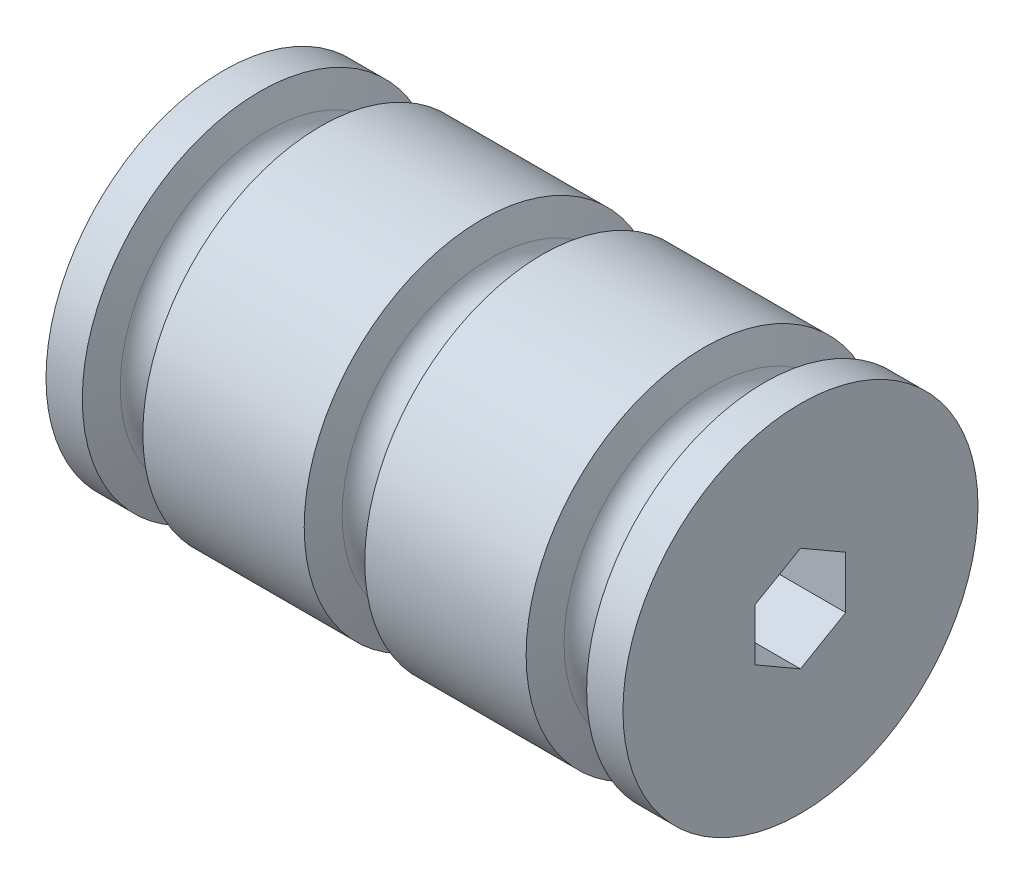
ISO-10303-21;
HEADER;
FILE_DESCRIPTION(('STEP AP214'),'2;1');
FILE_NAME('part.step','',(''),(''),'','','');
FILE_SCHEMA(('AUTOMOTIVE_DESIGN { 1 0 10303 214 1 1 1 1 }'));
ENDSEC;
DATA;
#1=APPLICATION_CONTEXT('core data for automotive mechanical design processes');
#2=APPLICATION_PROTOCOL_DEFINITION('international standard','automotive_design',2000,#1);
#3=PRODUCT_CONTEXT('',#1,'mechanical');
#4=PRODUCT('Part','Part','',(#3));
#5=PRODUCT_RELATED_PRODUCT_CATEGORY('part','',(#4));
#6=PRODUCT_DEFINITION_FORMATION('','',#4);
#7=PRODUCT_DEFINITION_CONTEXT('part definition',#1,'design');
#8=PRODUCT_DEFINITION('design','',#6,#7);
#9=PRODUCT_DEFINITION_SHAPE('','',#8);
#10=(LENGTH_UNIT() NAMED_UNIT(*) SI_UNIT(.MILLI.,.METRE.));
#11=(NAMED_UNIT(*) PLANE_ANGLE_UNIT() SI_UNIT($,.RADIAN.));
#12=(NAMED_UNIT(*) SI_UNIT($,.STERADIAN.) SOLID_ANGLE_UNIT());
#13=UNCERTAINTY_MEASURE_WITH_UNIT(LENGTH_MEASURE(1.E-05),#10,'distance_accuracy_value','');
#14=(GEOMETRIC_REPRESENTATION_CONTEXT(3) GLOBAL_UNCERTAINTY_ASSIGNED_CONTEXT((#13)) GLOBAL_UNIT_ASSIGNED_CONTEXT((#10,
#11,#12)) REPRESENTATION_CONTEXT('',''));
#15=CARTESIAN_POINT('',(0.,0.,0.));
#16=DIRECTION('',(0.,0.,1.));
#17=DIRECTION('',(1.,0.,0.));
#18=AXIS2_PLACEMENT_3D('',#15,#16,#17);
#19=CARTESIAN_POINT('',(0.,0.,0.));
#20=DIRECTION('',(1.,0.,0.));
#21=DIRECTION('',(0.,0.,-1.));
#22=AXIS2_PLACEMENT_3D('',#19,#20,#21);
#23=CYLINDRICAL_SURFACE('',#22,25.4);
#24=CARTESIAN_POINT('',(5.19484637298716,0.,0.));
#25=DIRECTION('',(1.,0.,0.));
#26=DIRECTION('',(0.,0.,-1.));
#27=AXIS2_PLACEMENT_3D('',#24,#25,#26);
#28=CIRCLE('',#27,25.4);
#29=CARTESIAN_POINT('',(5.19484637298716,0.,-25.4));
#30=VERTEX_POINT('',#29);
#31=EDGE_CURVE('E193',#30,#30,#28,.T.);
#32=ORIENTED_EDGE('',*,*,#31,.F.);
#33=EDGE_LOOP('',(#32));
#34=FACE_BOUND('',#33,.T.);
#35=CARTESIAN_POINT('',(0.,0.,0.));
#36=DIRECTION('',(1.,0.,0.));
#37=DIRECTION('',(0.,0.,-1.));
#38=AXIS2_PLACEMENT_3D('',#35,#36,#37);
#39=CIRCLE('',#38,25.4);
#40=CARTESIAN_POINT('',(0.,0.,-25.4));
#41=VERTEX_POINT('',#40);
#42=EDGE_CURVE('E11',#41,#41,#39,.T.);
#43=ORIENTED_EDGE('',*,*,#42,.T.);
#44=EDGE_LOOP('',(#43));
#45=FACE_BOUND('',#44,.T.);
#46=ADVANCED_FACE('F41',(#34,#45),#23,.T.);
#47=CARTESIAN_POINT('',(0.,0.,0.));
#48=DIRECTION('',(-1.,0.,0.));
#49=DIRECTION('',(0.,0.,1.));
#50=AXIS2_PLACEMENT_3D('',#47,#48,#49);
#51=PLANE('',#50);
#52=DIRECTION('',(0.,0.5,-0.866025403784439));
#53=VECTOR('',#52,1.);
#54=CARTESIAN_POINT('',(0.,3.73949769354121,6.477));
#55=LINE('',#54,#53);
#56=CARTESIAN_POINT('',(0.,3.73949769354121,6.477));
#57=VERTEX_POINT('',#56);
#58=CARTESIAN_POINT('',(0.,7.47899538708242,0.));
#59=VERTEX_POINT('',#58);
#60=EDGE_CURVE('E59',#57,#59,#55,.T.);
#61=ORIENTED_EDGE('',*,*,#60,.F.);
#62=DIRECTION('',(0.,1.,0.));
#63=VECTOR('',#62,1.);
#64=CARTESIAN_POINT('',(0.,-3.73949769354121,6.477));
#65=LINE('',#64,#63);
#66=CARTESIAN_POINT('',(0.,-3.73949769354121,6.477));
#67=VERTEX_POINT('',#66);
#68=EDGE_CURVE('E129',#67,#57,#65,.T.);
#69=ORIENTED_EDGE('',*,*,#68,.F.);
#70=DIRECTION('',(0.,0.5,0.866025403784439));
#71=VECTOR('',#70,1.);
#72=CARTESIAN_POINT('',(0.,-7.47899538708241,0.));
#73=LINE('',#72,#71);
#74=CARTESIAN_POINT('',(0.,-7.47899538708241,0.));
#75=VERTEX_POINT('',#74);
#76=EDGE_CURVE('E135',#75,#67,#73,.T.);
#77=ORIENTED_EDGE('',*,*,#76,.F.);
#78=DIRECTION('',(0.,-0.5,0.866025403784439));
#79=VECTOR('',#78,1.);
#80=CARTESIAN_POINT('',(0.,-3.73949769354121,-6.477));
#81=LINE('',#80,#79);
#82=CARTESIAN_POINT('',(0.,-3.73949769354121,-6.477));
#83=VERTEX_POINT('',#82);
#84=EDGE_CURVE('E158',#83,#75,#81,.T.);
#85=ORIENTED_EDGE('',*,*,#84,.F.);
#86=DIRECTION('',(0.,-1.,0.));
#87=VECTOR('',#86,1.);
#88=CARTESIAN_POINT('',(0.,3.73949769354121,-6.477));
#89=LINE('',#88,#87);
#90=CARTESIAN_POINT('',(0.,3.73949769354121,-6.477));
#91=VERTEX_POINT('',#90);
#92=EDGE_CURVE('E154',#91,#83,#89,.T.);
#93=ORIENTED_EDGE('',*,*,#92,.F.);
#94=DIRECTION('',(0.,-0.5,-0.866025403784439));
#95=VECTOR('',#94,1.);
#96=CARTESIAN_POINT('',(0.,7.47899538708241,0.));
#97=LINE('',#96,#95);
#98=EDGE_CURVE('E151',#59,#91,#97,.T.);
#99=ORIENTED_EDGE('',*,*,#98,.F.);
#100=EDGE_LOOP('',(#61,#69,#77,#85,#93,#99));
#101=FACE_BOUND('',#100,.T.);
#102=ORIENTED_EDGE('',*,*,#42,.F.);
#103=EDGE_LOOP('',(#102));
#104=FACE_BOUND('',#103,.T.);
#105=ADVANCED_FACE('F43',(#101,#104),#51,.T.);
#106=CARTESIAN_POINT('',(5.19484637298716,0.,0.));
#107=DIRECTION('',(-1.,0.,0.));
#108=DIRECTION('',(0.,0.,1.));
#109=AXIS2_PLACEMENT_3D('',#106,#107,#108);
#110=CONICAL_SURFACE('',#109,25.4,1.26536370769589);
#111=CARTESIAN_POINT('',(6.49694868137437,0.,0.));
#112=DIRECTION('',(1.,0.,0.));
#113=DIRECTION('',(0.,0.,-1.));
#114=AXIS2_PLACEMENT_3D('',#111,#112,#113);
#115=CIRCLE('',#114,21.2702590865739);
#116=CARTESIAN_POINT('',(6.49694868137437,0.,-21.2702590865739));
#117=VERTEX_POINT('',#116);
#118=EDGE_CURVE('E189',#117,#117,#115,.T.);
#119=ORIENTED_EDGE('',*,*,#118,.F.);
#120=EDGE_LOOP('',(#119));
#121=FACE_BOUND('',#120,.T.);
#122=ORIENTED_EDGE('',*,*,#31,.T.);
#123=EDGE_LOOP('',(#122));
#124=FACE_BOUND('',#123,.T.);
#125=ADVANCED_FACE('F280',(#121,#124),#110,.T.);
#126=CARTESIAN_POINT('',(9.525,0.,0.));
#127=DIRECTION('',(1.,0.,0.));
#128=DIRECTION('',(0.,0.,-1.));
#129=AXIS2_PLACEMENT_3D('',#126,#127,#128);
#130=TOROIDAL_SURFACE('',#129,22.225,3.175);
#131=CARTESIAN_POINT('',(12.5530513186256,0.,0.));
#132=DIRECTION('',(1.,0.,0.));
#133=DIRECTION('',(0.,0.,-1.));
#134=AXIS2_PLACEMENT_3D('',#131,#132,#133);
#135=CIRCLE('',#134,21.2702590865739);
#136=CARTESIAN_POINT('',(12.5530513186256,0.,-21.2702590865739));
#137=VERTEX_POINT('',#136);
#138=EDGE_CURVE('E184',#137,#137,#135,.T.);
#139=ORIENTED_EDGE('',*,*,#138,.F.);
#140=EDGE_LOOP('',(#139));
#141=FACE_BOUND('',#140,.T.);
#142=ORIENTED_EDGE('',*,*,#118,.T.);
#143=EDGE_LOOP('',(#142));
#144=FACE_BOUND('',#143,.T.);
#145=ADVANCED_FACE('F268',(#141,#144),#130,.F.);
#146=CARTESIAN_POINT('',(12.5530513186256,0.,0.));
#147=DIRECTION('',(1.,0.,0.));
#148=DIRECTION('',(0.,0.,-1.));
#149=AXIS2_PLACEMENT_3D('',#146,#147,#148);
#150=CONICAL_SURFACE('',#149,21.2702590865739,1.26536370769589);
#151=CARTESIAN_POINT('',(13.8551536270128,0.,0.));
#152=DIRECTION('',(1.,0.,0.));
#153=DIRECTION('',(0.,0.,-1.));
#154=AXIS2_PLACEMENT_3D('',#151,#152,#153);
#155=CIRCLE('',#154,25.4);
#156=CARTESIAN_POINT('',(13.8551536270128,0.,-25.4));
#157=VERTEX_POINT('',#156);
#158=EDGE_CURVE('E180',#157,#157,#155,.T.);
#159=ORIENTED_EDGE('',*,*,#158,.F.);
#160=EDGE_LOOP('',(#159));
#161=FACE_BOUND('',#160,.T.);
#162=ORIENTED_EDGE('',*,*,#138,.T.);
#163=EDGE_LOOP('',(#162));
#164=FACE_BOUND('',#163,.T.);
#165=ADVANCED_FACE('F260',(#161,#164),#150,.T.);
#166=ORIENTED_EDGE('',*,*,#158,.T.);
#167=EDGE_LOOP('',(#166));
#168=FACE_BOUND('',#167,.T.);
#169=CARTESIAN_POINT('',(36.9448463729872,0.,0.));
#170=DIRECTION('',(1.,0.,0.));
#171=DIRECTION('',(0.,0.,-1.));
#172=AXIS2_PLACEMENT_3D('',#169,#170,#171);
#173=CIRCLE('',#172,25.4);
#174=CARTESIAN_POINT('',(36.9448463729872,0.,-25.4));
#175=VERTEX_POINT('',#174);
#176=EDGE_CURVE('E185',#175,#175,#173,.T.);
#177=ORIENTED_EDGE('',*,*,#176,.F.);
#178=EDGE_LOOP('',(#177));
#179=FACE_BOUND('',#178,.T.);
#180=ADVANCED_FACE('F242',(#168,#179),#23,.T.);
#181=CARTESIAN_POINT('',(36.9448463729872,0.,0.));
#182=DIRECTION('',(-1.,0.,0.));
#183=DIRECTION('',(0.,0.,1.));
#184=AXIS2_PLACEMENT_3D('',#181,#182,#183);
#185=CONICAL_SURFACE('',#184,25.4,1.26536370769589);
#186=CARTESIAN_POINT('',(38.2469486813744,0.,0.));
#187=DIRECTION('',(1.,0.,0.));
#188=DIRECTION('',(0.,0.,-1.));
#189=AXIS2_PLACEMENT_3D('',#186,#187,#188);
#190=CIRCLE('',#189,21.2702590865739);
#191=CARTESIAN_POINT('',(38.2469486813744,0.,-21.2702590865739));
#192=VERTEX_POINT('',#191);
#193=EDGE_CURVE('E206',#192,#192,#190,.T.);
#194=ORIENTED_EDGE('',*,*,#193,.F.);
#195=EDGE_LOOP('',(#194));
#196=FACE_BOUND('',#195,.T.);
#197=ORIENTED_EDGE('',*,*,#176,.T.);
#198=EDGE_LOOP('',(#197));
#199=FACE_BOUND('',#198,.T.);
#200=ADVANCED_FACE('F259',(#196,#199),#185,.T.);
#201=CARTESIAN_POINT('',(41.275,0.,0.));
#202=DIRECTION('',(1.,0.,0.));
#203=DIRECTION('',(0.,0.,-1.));
#204=AXIS2_PLACEMENT_3D('',#201,#202,#203);
#205=TOROIDAL_SURFACE('',#204,22.225,3.175);
#206=CARTESIAN_POINT('',(44.3030513186256,0.,0.));
#207=DIRECTION('',(1.,0.,0.));
#208=DIRECTION('',(0.,0.,-1.));
#209=AXIS2_PLACEMENT_3D('',#206,#207,#208);
#210=CIRCLE('',#209,21.2702590865739);
#211=CARTESIAN_POINT('',(44.3030513186256,0.,-21.2702590865739));
#212=VERTEX_POINT('',#211);
#213=EDGE_CURVE('E201',#212,#212,#210,.T.);
#214=ORIENTED_EDGE('',*,*,#213,.F.);
#215=EDGE_LOOP('',(#214));
#216=FACE_BOUND('',#215,.T.);
#217=ORIENTED_EDGE('',*,*,#193,.T.);
#218=EDGE_LOOP('',(#217));
#219=FACE_BOUND('',#218,.T.);
#220=ADVANCED_FACE('F254',(#216,#219),#205,.F.);
#221=CARTESIAN_POINT('',(44.3030513186256,0.,0.));
#222=DIRECTION('',(1.,0.,0.));
#223=DIRECTION('',(0.,0.,-1.));
#224=AXIS2_PLACEMENT_3D('',#221,#222,#223);
#225=CONICAL_SURFACE('',#224,21.2702590865739,1.26536370769589);
#226=CARTESIAN_POINT('',(45.6051536270128,0.,0.));
#227=DIRECTION('',(1.,0.,0.));
#228=DIRECTION('',(0.,0.,-1.));
#229=AXIS2_PLACEMENT_3D('',#226,#227,#228);
#230=CIRCLE('',#229,25.4);
#231=CARTESIAN_POINT('',(45.6051536270128,0.,-25.4));
#232=VERTEX_POINT('',#231);
#233=EDGE_CURVE('E197',#232,#232,#230,.T.);
#234=ORIENTED_EDGE('',*,*,#233,.F.);
#235=EDGE_LOOP('',(#234));
#236=FACE_BOUND('',#235,.T.);
#237=ORIENTED_EDGE('',*,*,#213,.T.);
#238=EDGE_LOOP('',(#237));
#239=FACE_BOUND('',#238,.T.);
#240=ADVANCED_FACE('F245',(#236,#239),#225,.T.);
#241=ORIENTED_EDGE('',*,*,#233,.T.);
#242=EDGE_LOOP('',(#241));
#243=FACE_BOUND('',#242,.T.);
#244=CARTESIAN_POINT('',(68.6948463729872,0.,0.));
#245=DIRECTION('',(1.,0.,0.));
#246=DIRECTION('',(0.,0.,-1.));
#247=AXIS2_PLACEMENT_3D('',#244,#245,#246);
#248=CIRCLE('',#247,25.4);
#249=CARTESIAN_POINT('',(68.6948463729872,0.,-25.4));
#250=VERTEX_POINT('',#249);
#251=EDGE_CURVE('E202',#250,#250,#248,.T.);
#252=ORIENTED_EDGE('',*,*,#251,.F.);
#253=EDGE_LOOP('',(#252));
#254=FACE_BOUND('',#253,.T.);
#255=ADVANCED_FACE('F231',(#243,#254),#23,.T.);
#256=CARTESIAN_POINT('',(68.6948463729872,0.,0.));
#257=DIRECTION('',(-1.,0.,0.));
#258=DIRECTION('',(0.,0.,1.));
#259=AXIS2_PLACEMENT_3D('',#256,#257,#258);
#260=CONICAL_SURFACE('',#259,25.4,1.26536370769589);
#261=CARTESIAN_POINT('',(69.9969486813744,0.,0.));
#262=DIRECTION('',(1.,0.,0.));
#263=DIRECTION('',(0.,0.,-1.));
#264=AXIS2_PLACEMENT_3D('',#261,#262,#263);
#265=CIRCLE('',#264,21.2702590865739);
#266=CARTESIAN_POINT('',(69.9969486813744,0.,-21.2702590865739));
#267=VERTEX_POINT('',#266);
#268=EDGE_CURVE('E220',#267,#267,#265,.T.);
#269=ORIENTED_EDGE('',*,*,#268,.F.);
#270=EDGE_LOOP('',(#269));
#271=FACE_BOUND('',#270,.T.);
#272=ORIENTED_EDGE('',*,*,#251,.T.);
#273=EDGE_LOOP('',(#272));
#274=FACE_BOUND('',#273,.T.);
#275=ADVANCED_FACE('F244',(#271,#274),#260,.T.);
#276=CARTESIAN_POINT('',(73.025,0.,0.));
#277=DIRECTION('',(1.,0.,0.));
#278=DIRECTION('',(0.,0.,-1.));
#279=AXIS2_PLACEMENT_3D('',#276,#277,#278);
#280=TOROIDAL_SURFACE('',#279,22.225,3.175);
#281=CARTESIAN_POINT('',(76.0530513186256,0.,0.));
#282=DIRECTION('',(1.,0.,0.));
#283=DIRECTION('',(0.,0.,-1.));
#284=AXIS2_PLACEMENT_3D('',#281,#282,#283);
#285=CIRCLE('',#284,21.2702590865739);
#286=CARTESIAN_POINT('',(76.0530513186256,0.,-21.2702590865739));
#287=VERTEX_POINT('',#286);
#288=EDGE_CURVE('E216',#287,#287,#285,.T.);
#289=ORIENTED_EDGE('',*,*,#288,.F.);
#290=EDGE_LOOP('',(#289));
#291=FACE_BOUND('',#290,.T.);
#292=ORIENTED_EDGE('',*,*,#268,.T.);
#293=EDGE_LOOP('',(#292));
#294=FACE_BOUND('',#293,.T.);
#295=ADVANCED_FACE('F251',(#291,#294),#280,.F.);
#296=CARTESIAN_POINT('',(76.0530513186256,0.,0.));
#297=DIRECTION('',(1.,0.,0.));
#298=DIRECTION('',(0.,0.,-1.));
#299=AXIS2_PLACEMENT_3D('',#296,#297,#298);
#300=CONICAL_SURFACE('',#299,21.2702590865739,1.26536370769589);
#301=CARTESIAN_POINT('',(77.3551536270128,0.,0.));
#302=DIRECTION('',(1.,0.,0.));
#303=DIRECTION('',(0.,0.,-1.));
#304=AXIS2_PLACEMENT_3D('',#301,#302,#303);
#305=CIRCLE('',#304,25.4);
#306=CARTESIAN_POINT('',(77.3551536270128,0.,-25.4));
#307=VERTEX_POINT('',#306);
#308=EDGE_CURVE('E168',#307,#307,#305,.T.);
#309=ORIENTED_EDGE('',*,*,#308,.F.);
#310=EDGE_LOOP('',(#309));
#311=FACE_BOUND('',#310,.T.);
#312=ORIENTED_EDGE('',*,*,#288,.T.);
#313=EDGE_LOOP('',(#312));
#314=FACE_BOUND('',#313,.T.);
#315=ADVANCED_FACE('F238',(#311,#314),#300,.T.);
#316=CARTESIAN_POINT('',(82.55,0.,0.));
#317=DIRECTION('',(1.,0.,0.));
#318=DIRECTION('',(0.,0.,-1.));
#319=AXIS2_PLACEMENT_3D('',#316,#317,#318);
#320=PLANE('',#319);
#321=DIRECTION('',(0.,0.5,-0.866025403784439));
#322=VECTOR('',#321,1.);
#323=CARTESIAN_POINT('',(82.55,3.73949769354121,6.477));
#324=LINE('',#323,#322);
#325=CARTESIAN_POINT('',(82.55,3.73949769354121,6.477));
#326=VERTEX_POINT('',#325);
#327=CARTESIAN_POINT('',(82.55,7.47899538708241,0.));
#328=VERTEX_POINT('',#327);
#329=EDGE_CURVE('E109',#326,#328,#324,.T.);
#330=ORIENTED_EDGE('',*,*,#329,.T.);
#331=DIRECTION('',(0.,-0.5,-0.866025403784439));
#332=VECTOR('',#331,1.);
#333=CARTESIAN_POINT('',(82.55,7.47899538708241,0.));
#334=LINE('',#333,#332);
#335=CARTESIAN_POINT('',(82.55,3.73949769354121,-6.477));
#336=VERTEX_POINT('',#335);
#337=EDGE_CURVE('E119',#328,#336,#334,.T.);
#338=ORIENTED_EDGE('',*,*,#337,.T.);
#339=DIRECTION('',(0.,-1.,0.));
#340=VECTOR('',#339,1.);
#341=CARTESIAN_POINT('',(82.55,3.73949769354121,-6.477));
#342=LINE('',#341,#340);
#343=CARTESIAN_POINT('',(82.55,-3.73949769354121,-6.477));
#344=VERTEX_POINT('',#343);
#345=EDGE_CURVE('E70',#336,#344,#342,.T.);
#346=ORIENTED_EDGE('',*,*,#345,.T.);
#347=DIRECTION('',(0.,-0.5,0.866025403784439));
#348=VECTOR('',#347,1.);
#349=CARTESIAN_POINT('',(82.55,-3.73949769354121,-6.477));
#350=LINE('',#349,#348);
#351=CARTESIAN_POINT('',(82.55,-7.47899538708241,0.));
#352=VERTEX_POINT('',#351);
#353=EDGE_CURVE('E140',#344,#352,#350,.T.);
#354=ORIENTED_EDGE('',*,*,#353,.T.);
#355=DIRECTION('',(0.,0.5,0.866025403784439));
#356=VECTOR('',#355,1.);
#357=CARTESIAN_POINT('',(82.55,-7.47899538708241,0.));
#358=LINE('',#357,#356);
#359=CARTESIAN_POINT('',(82.55,-3.73949769354121,6.477));
#360=VERTEX_POINT('',#359);
#361=EDGE_CURVE('E144',#352,#360,#358,.T.);
#362=ORIENTED_EDGE('',*,*,#361,.T.);
#363=DIRECTION('',(0.,1.,0.));
#364=VECTOR('',#363,1.);
#365=CARTESIAN_POINT('',(82.55,-3.73949769354121,6.477));
#366=LINE('',#365,#364);
#367=EDGE_CURVE('E116',#360,#326,#366,.T.);
#368=ORIENTED_EDGE('',*,*,#367,.T.);
#369=EDGE_LOOP('',(#330,#338,#346,#354,#362,#368));
#370=FACE_BOUND('',#369,.T.);
#371=CARTESIAN_POINT('',(82.55,0.,0.));
#372=DIRECTION('',(1.,0.,0.));
#373=DIRECTION('',(0.,0.,-1.));
#374=AXIS2_PLACEMENT_3D('',#371,#372,#373);
#375=CIRCLE('',#374,25.4);
#376=CARTESIAN_POINT('',(82.55,0.,-25.4));
#377=VERTEX_POINT('',#376);
#378=EDGE_CURVE('E50',#377,#377,#375,.T.);
#379=ORIENTED_EDGE('',*,*,#378,.T.);
#380=EDGE_LOOP('',(#379));
#381=FACE_BOUND('',#380,.T.);
#382=ADVANCED_FACE('F124',(#370,#381),#320,.T.);
#383=ORIENTED_EDGE('',*,*,#308,.T.);
#384=EDGE_LOOP('',(#383));
#385=FACE_BOUND('',#384,.T.);
#386=ORIENTED_EDGE('',*,*,#378,.F.);
#387=EDGE_LOOP('',(#386));
#388=FACE_BOUND('',#387,.T.);
#389=ADVANCED_FACE('F228',(#385,#388),#23,.T.);
#390=CARTESIAN_POINT('',(82.55,3.73949769354121,6.477));
#391=DIRECTION('',(0.,0.866025403784439,0.5));
#392=DIRECTION('',(0.,-0.5,0.866025403784439));
#393=AXIS2_PLACEMENT_3D('',#390,#391,#392);
#394=PLANE('',#393);
#395=ORIENTED_EDGE('',*,*,#60,.T.);
#396=DIRECTION('',(-1.,0.,0.));
#397=VECTOR('',#396,1.);
#398=CARTESIAN_POINT('',(82.55,7.47899538708241,0.));
#399=LINE('',#398,#397);
#400=EDGE_CURVE('E105',#328,#59,#399,.T.);
#401=ORIENTED_EDGE('',*,*,#400,.F.);
#402=ORIENTED_EDGE('',*,*,#329,.F.);
#403=DIRECTION('',(-1.,0.,0.));
#404=VECTOR('',#403,1.);
#405=CARTESIAN_POINT('',(82.55,3.73949769354121,6.477));
#406=LINE('',#405,#404);
#407=EDGE_CURVE('E165',#326,#57,#406,.T.);
#408=ORIENTED_EDGE('',*,*,#407,.T.);
#409=EDGE_LOOP('',(#395,#401,#402,#408));
#410=FACE_BOUND('',#409,.T.);
#411=ADVANCED_FACE('F107',(#410),#394,.F.);
#412=CARTESIAN_POINT('',(82.55,-3.73949769354121,6.477));
#413=DIRECTION('',(0.,0.,1.));
#414=DIRECTION('',(0.,-1.,0.));
#415=AXIS2_PLACEMENT_3D('',#412,#413,#414);
#416=PLANE('',#415);
#417=ORIENTED_EDGE('',*,*,#68,.T.);
#418=ORIENTED_EDGE('',*,*,#407,.F.);
#419=ORIENTED_EDGE('',*,*,#367,.F.);
#420=DIRECTION('',(-1.,0.,0.));
#421=VECTOR('',#420,1.);
#422=CARTESIAN_POINT('',(82.55,-3.73949769354121,6.477));
#423=LINE('',#422,#421);
#424=EDGE_CURVE('E169',#360,#67,#423,.T.);
#425=ORIENTED_EDGE('',*,*,#424,.T.);
#426=EDGE_LOOP('',(#417,#418,#419,#425));
#427=FACE_BOUND('',#426,.T.);
#428=ADVANCED_FACE('F236',(#427),#416,.F.);
#429=CARTESIAN_POINT('',(82.55,-7.47899538708241,0.));
#430=DIRECTION('',(0.,-0.866025403784439,0.5));
#431=DIRECTION('',(0.,-0.5,-0.866025403784439));
#432=AXIS2_PLACEMENT_3D('',#429,#430,#431);
#433=PLANE('',#432);
#434=ORIENTED_EDGE('',*,*,#76,.T.);
#435=ORIENTED_EDGE('',*,*,#424,.F.);
#436=ORIENTED_EDGE('',*,*,#361,.F.);
#437=DIRECTION('',(-1.,0.,0.));
#438=VECTOR('',#437,1.);
#439=CARTESIAN_POINT('',(82.55,-7.47899538708241,0.));
#440=LINE('',#439,#438);
#441=EDGE_CURVE('E172',#352,#75,#440,.T.);
#442=ORIENTED_EDGE('',*,*,#441,.T.);
#443=EDGE_LOOP('',(#434,#435,#436,#442));
#444=FACE_BOUND('',#443,.T.);
#445=ADVANCED_FACE('F305',(#444),#433,.F.);
#446=CARTESIAN_POINT('',(82.55,-3.73949769354121,-6.477));
#447=DIRECTION('',(0.,-0.866025403784439,-0.5));
#448=DIRECTION('',(0.,0.5,-0.866025403784439));
#449=AXIS2_PLACEMENT_3D('',#446,#447,#448);
#450=PLANE('',#449);
#451=ORIENTED_EDGE('',*,*,#84,.T.);
#452=ORIENTED_EDGE('',*,*,#441,.F.);
#453=ORIENTED_EDGE('',*,*,#353,.F.);
#454=DIRECTION('',(-1.,0.,0.));
#455=VECTOR('',#454,1.);
#456=CARTESIAN_POINT('',(82.55,-3.73949769354121,-6.477));
#457=LINE('',#456,#455);
#458=EDGE_CURVE('E175',#344,#83,#457,.T.);
#459=ORIENTED_EDGE('',*,*,#458,.T.);
#460=EDGE_LOOP('',(#451,#452,#453,#459));
#461=FACE_BOUND('',#460,.T.);
#462=ADVANCED_FACE('F302',(#461),#450,.F.);
#463=CARTESIAN_POINT('',(82.55,3.73949769354121,-6.477));
#464=DIRECTION('',(0.,0.,-1.));
#465=DIRECTION('',(0.,1.,0.));
#466=AXIS2_PLACEMENT_3D('',#463,#464,#465);
#467=PLANE('',#466);
#468=ORIENTED_EDGE('',*,*,#92,.T.);
#469=ORIENTED_EDGE('',*,*,#458,.F.);
#470=ORIENTED_EDGE('',*,*,#345,.F.);
#471=DIRECTION('',(-1.,0.,0.));
#472=VECTOR('',#471,1.);
#473=CARTESIAN_POINT('',(82.55,3.73949769354121,-6.477));
#474=LINE('',#473,#472);
#475=EDGE_CURVE('E115',#336,#91,#474,.T.);
#476=ORIENTED_EDGE('',*,*,#475,.T.);
#477=EDGE_LOOP('',(#468,#469,#470,#476));
#478=FACE_BOUND('',#477,.T.);
#479=ADVANCED_FACE('F299',(#478),#467,.F.);
#480=CARTESIAN_POINT('',(82.55,7.47899538708241,0.));
#481=DIRECTION('',(0.,0.866025403784439,-0.5));
#482=DIRECTION('',(0.,0.5,0.866025403784439));
#483=AXIS2_PLACEMENT_3D('',#480,#481,#482);
#484=PLANE('',#483);
#485=ORIENTED_EDGE('',*,*,#98,.T.);
#486=ORIENTED_EDGE('',*,*,#475,.F.);
#487=ORIENTED_EDGE('',*,*,#337,.F.);
#488=ORIENTED_EDGE('',*,*,#400,.T.);
#489=EDGE_LOOP('',(#485,#486,#487,#488));
#490=FACE_BOUND('',#489,.T.);
#491=ADVANCED_FACE('F120',(#490),#484,.F.);
#492=CLOSED_SHELL('',(#46,#105,#125,#145,#165,#180,#200,#220,#240,#255,#275,#295,#315,#382,#389,
#411,#428,#445,#462,#479,#491));
#493=MANIFOLD_SOLID_BREP('B2',#492);
#494=ADVANCED_BREP_SHAPE_REPRESENTATION('',(#18,#493),#14);
#495=SHAPE_DEFINITION_REPRESENTATION(#9,#494);
ENDSEC;
END-ISO-10303-21;
